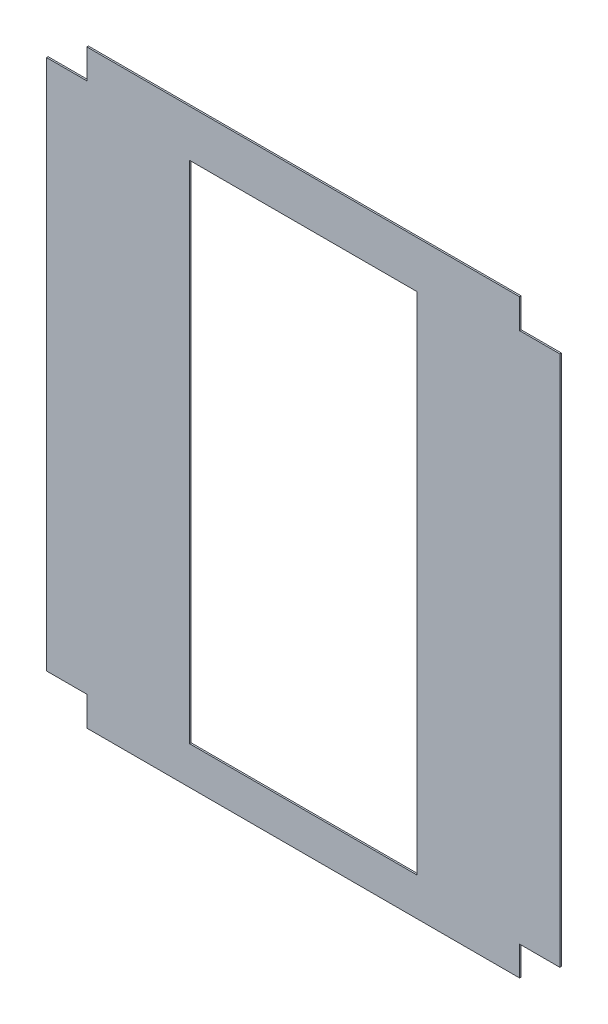
ISO-10303-21;
HEADER;
FILE_DESCRIPTION(('STEP AP214'),'2;1');
FILE_NAME('part.step','',(''),(''),'','','');
FILE_SCHEMA(('AUTOMOTIVE_DESIGN { 1 0 10303 214 1 1 1 1 }'));
ENDSEC;
DATA;
#1=APPLICATION_CONTEXT('core data for automotive mechanical design processes');
#2=APPLICATION_PROTOCOL_DEFINITION('international standard','automotive_design',2000,#1);
#3=PRODUCT_CONTEXT('',#1,'mechanical');
#4=PRODUCT('Part','Part','',(#3));
#5=PRODUCT_RELATED_PRODUCT_CATEGORY('part','',(#4));
#6=PRODUCT_DEFINITION_FORMATION('','',#4);
#7=PRODUCT_DEFINITION_CONTEXT('part definition',#1,'design');
#8=PRODUCT_DEFINITION('design','',#6,#7);
#9=PRODUCT_DEFINITION_SHAPE('','',#8);
#10=(LENGTH_UNIT() NAMED_UNIT(*) SI_UNIT(.MILLI.,.METRE.));
#11=(NAMED_UNIT(*) PLANE_ANGLE_UNIT() SI_UNIT($,.RADIAN.));
#12=(NAMED_UNIT(*) SI_UNIT($,.STERADIAN.) SOLID_ANGLE_UNIT());
#13=UNCERTAINTY_MEASURE_WITH_UNIT(LENGTH_MEASURE(1.E-05),#10,'distance_accuracy_value','');
#14=(GEOMETRIC_REPRESENTATION_CONTEXT(3) GLOBAL_UNCERTAINTY_ASSIGNED_CONTEXT((#13)) GLOBAL_UNIT_ASSIGNED_CONTEXT((#10,
#11,#12)) REPRESENTATION_CONTEXT('',''));
#15=CARTESIAN_POINT('',(0.,0.,0.));
#16=DIRECTION('',(0.,0.,1.));
#17=DIRECTION('',(1.,0.,0.));
#18=AXIS2_PLACEMENT_3D('',#15,#16,#17);
#19=CARTESIAN_POINT('',(0.,0.,6.35));
#20=DIRECTION('',(0.,0.,-1.));
#21=DIRECTION('',(-1.,0.,0.));
#22=AXIS2_PLACEMENT_3D('',#19,#20,#21);
#23=PLANE('',#22);
#24=DIRECTION('',(0.,1.,0.));
#25=VECTOR('',#24,1.);
#26=CARTESIAN_POINT('',(848.581697288669,1062.67558837392,6.35));
#27=LINE('',#26,#25);
#28=CARTESIAN_POINT('',(848.581697288669,-1073.95215165757,6.35));
#29=VERTEX_POINT('',#28);
#30=CARTESIAN_POINT('',(848.581697288669,1062.67558837392,6.35));
#31=VERTEX_POINT('',#30);
#32=EDGE_CURVE('E182',#29,#31,#27,.T.);
#33=ORIENTED_EDGE('',*,*,#32,.T.);
#34=DIRECTION('',(-1.,0.,0.));
#35=VECTOR('',#34,1.);
#36=CARTESIAN_POINT('',(686.529697288669,1062.67558837392,6.35));
#37=LINE('',#36,#35);
#38=CARTESIAN_POINT('',(686.529697288669,1062.67558837392,6.35));
#39=VERTEX_POINT('',#38);
#40=EDGE_CURVE('E185',#31,#39,#37,.T.);
#41=ORIENTED_EDGE('',*,*,#40,.T.);
#42=DIRECTION('',(0.,1.,0.));
#43=VECTOR('',#42,1.);
#44=CARTESIAN_POINT('',(686.529697288669,1180.78558837392,6.35));
#45=LINE('',#44,#43);
#46=CARTESIAN_POINT('',(686.529697288669,1180.78558837392,6.35));
#47=VERTEX_POINT('',#46);
#48=EDGE_CURVE('E188',#39,#47,#45,.T.);
#49=ORIENTED_EDGE('',*,*,#48,.T.);
#50=DIRECTION('',(-1.,0.,0.));
#51=VECTOR('',#50,1.);
#52=CARTESIAN_POINT('',(-1053.973,1180.78558837392,6.35));
#53=LINE('',#52,#51);
#54=CARTESIAN_POINT('',(-1053.973,1180.78558837392,6.35));
#55=VERTEX_POINT('',#54);
#56=EDGE_CURVE('E190',#47,#55,#53,.T.);
#57=ORIENTED_EDGE('',*,*,#56,.T.);
#58=DIRECTION('',(0.,-1.,0.));
#59=VECTOR('',#58,1.);
#60=CARTESIAN_POINT('',(-1053.973,1062.67558837392,6.35));
#61=LINE('',#60,#59);
#62=CARTESIAN_POINT('',(-1053.973,1062.67558837392,6.35));
#63=VERTEX_POINT('',#62);
#64=EDGE_CURVE('E192',#55,#63,#61,.T.);
#65=ORIENTED_EDGE('',*,*,#64,.T.);
#66=DIRECTION('',(-1.,0.,0.));
#67=VECTOR('',#66,1.);
#68=CARTESIAN_POINT('',(-1216.025,1062.67558837392,6.35));
#69=LINE('',#68,#67);
#70=CARTESIAN_POINT('',(-1216.025,1062.67558837392,6.35));
#71=VERTEX_POINT('',#70);
#72=EDGE_CURVE('E194',#63,#71,#69,.T.);
#73=ORIENTED_EDGE('',*,*,#72,.T.);
#74=DIRECTION('',(0.,-1.,0.));
#75=VECTOR('',#74,1.);
#76=CARTESIAN_POINT('',(-1216.025,-1073.95215165757,6.35));
#77=LINE('',#76,#75);
#78=CARTESIAN_POINT('',(-1216.025,-1073.95215165757,6.35));
#79=VERTEX_POINT('',#78);
#80=EDGE_CURVE('E196',#71,#79,#77,.T.);
#81=ORIENTED_EDGE('',*,*,#80,.T.);
#82=DIRECTION('',(1.,0.,0.));
#83=VECTOR('',#82,1.);
#84=CARTESIAN_POINT('',(-1053.973,-1073.95215165757,6.35));
#85=LINE('',#84,#83);
#86=CARTESIAN_POINT('',(-1053.973,-1073.95215165757,6.35));
#87=VERTEX_POINT('',#86);
#88=EDGE_CURVE('E198',#79,#87,#85,.T.);
#89=ORIENTED_EDGE('',*,*,#88,.T.);
#90=DIRECTION('',(0.,-1.,0.));
#91=VECTOR('',#90,1.);
#92=CARTESIAN_POINT('',(-1053.973,-1192.06215165757,6.35));
#93=LINE('',#92,#91);
#94=CARTESIAN_POINT('',(-1053.973,-1192.06215165757,6.35));
#95=VERTEX_POINT('',#94);
#96=EDGE_CURVE('E200',#87,#95,#93,.T.);
#97=ORIENTED_EDGE('',*,*,#96,.T.);
#98=DIRECTION('',(1.,0.,0.));
#99=VECTOR('',#98,1.);
#100=CARTESIAN_POINT('',(-1053.973,-1192.06215165757,6.35));
#101=LINE('',#100,#99);
#102=CARTESIAN_POINT('',(686.529697288669,-1192.06215165757,6.35));
#103=VERTEX_POINT('',#102);
#104=EDGE_CURVE('E202',#95,#103,#101,.T.);
#105=ORIENTED_EDGE('',*,*,#104,.T.);
#106=DIRECTION('',(0.,1.,0.));
#107=VECTOR('',#106,1.);
#108=CARTESIAN_POINT('',(686.529697288669,-1073.95215165757,6.35));
#109=LINE('',#108,#107);
#110=CARTESIAN_POINT('',(686.529697288669,-1073.95215165757,6.35));
#111=VERTEX_POINT('',#110);
#112=EDGE_CURVE('E204',#103,#111,#109,.T.);
#113=ORIENTED_EDGE('',*,*,#112,.T.);
#114=DIRECTION('',(1.,0.,0.));
#115=VECTOR('',#114,1.);
#116=CARTESIAN_POINT('',(848.581697288669,-1073.95215165757,6.35));
#117=LINE('',#116,#115);
#118=EDGE_CURVE('E206',#111,#29,#117,.T.);
#119=ORIENTED_EDGE('',*,*,#118,.T.);
#120=EDGE_LOOP('',(#33,#41,#49,#57,#65,#73,#81,#89,#97,#105,#113,#119));
#121=FACE_BOUND('',#120,.T.);
#122=DIRECTION('',(0.,-1.,0.));
#123=VECTOR('',#122,1.);
#124=CARTESIAN_POINT('',(-640.714999999999,-1039.66215165757,6.35));
#125=LINE('',#124,#123);
#126=CARTESIAN_POINT('',(-640.714999999999,992.337848342434,6.35));
#127=VERTEX_POINT('',#126);
#128=CARTESIAN_POINT('',(-640.714999999999,-1039.66215165757,6.35));
#129=VERTEX_POINT('',#128);
#130=EDGE_CURVE('E146',#127,#129,#125,.T.);
#131=ORIENTED_EDGE('',*,*,#130,.F.);
#132=DIRECTION('',(-1.,0.,0.));
#133=VECTOR('',#132,1.);
#134=CARTESIAN_POINT('',(-640.714999999999,992.337848342434,6.35));
#135=LINE('',#134,#133);
#136=CARTESIAN_POINT('',(273.685,992.337848342434,6.35));
#137=VERTEX_POINT('',#136);
#138=EDGE_CURVE('E168',#137,#127,#135,.T.);
#139=ORIENTED_EDGE('',*,*,#138,.F.);
#140=DIRECTION('',(0.,1.,0.));
#141=VECTOR('',#140,1.);
#142=CARTESIAN_POINT('',(273.685,992.337848342434,6.35));
#143=LINE('',#142,#141);
#144=CARTESIAN_POINT('',(273.685000000001,-1039.66215165757,6.35));
#145=VERTEX_POINT('',#144);
#146=EDGE_CURVE('E166',#145,#137,#143,.T.);
#147=ORIENTED_EDGE('',*,*,#146,.F.);
#148=DIRECTION('',(1.,0.,0.));
#149=VECTOR('',#148,1.);
#150=CARTESIAN_POINT('',(-640.714999999999,-1039.66215165757,6.35));
#151=LINE('',#150,#149);
#152=EDGE_CURVE('E154',#129,#145,#151,.T.);
#153=ORIENTED_EDGE('',*,*,#152,.F.);
#154=EDGE_LOOP('',(#131,#139,#147,#153));
#155=FACE_BOUND('',#154,.T.);
#156=ADVANCED_FACE('F33',(#121,#155),#23,.F.);
#157=CARTESIAN_POINT('',(0.,0.,0.));
#158=DIRECTION('',(0.,0.,-1.));
#159=DIRECTION('',(-1.,0.,0.));
#160=AXIS2_PLACEMENT_3D('',#157,#158,#159);
#161=PLANE('',#160);
#162=DIRECTION('',(0.,1.,0.));
#163=VECTOR('',#162,1.);
#164=CARTESIAN_POINT('',(848.581697288669,1062.67558837392,0.));
#165=LINE('',#164,#163);
#166=CARTESIAN_POINT('',(848.581697288669,-1073.95215165757,0.));
#167=VERTEX_POINT('',#166);
#168=CARTESIAN_POINT('',(848.581697288669,1062.67558837392,0.));
#169=VERTEX_POINT('',#168);
#170=EDGE_CURVE('E162',#167,#169,#165,.T.);
#171=ORIENTED_EDGE('',*,*,#170,.F.);
#172=DIRECTION('',(1.,0.,0.));
#173=VECTOR('',#172,1.);
#174=CARTESIAN_POINT('',(848.581697288669,-1073.95215165757,0.));
#175=LINE('',#174,#173);
#176=CARTESIAN_POINT('',(686.529697288669,-1073.95215165757,0.));
#177=VERTEX_POINT('',#176);
#178=EDGE_CURVE('E186',#177,#167,#175,.T.);
#179=ORIENTED_EDGE('',*,*,#178,.F.);
#180=DIRECTION('',(0.,1.,0.));
#181=VECTOR('',#180,1.);
#182=CARTESIAN_POINT('',(686.529697288669,-1073.95215165757,0.));
#183=LINE('',#182,#181);
#184=CARTESIAN_POINT('',(686.529697288669,-1192.06215165757,0.));
#185=VERTEX_POINT('',#184);
#186=EDGE_CURVE('E230',#185,#177,#183,.T.);
#187=ORIENTED_EDGE('',*,*,#186,.F.);
#188=DIRECTION('',(1.,0.,0.));
#189=VECTOR('',#188,1.);
#190=CARTESIAN_POINT('',(477.952095390508,-1192.06215165757,0.));
#191=LINE('',#190,#189);
#192=CARTESIAN_POINT('',(-1053.973,-1192.06215165757,0.));
#193=VERTEX_POINT('',#192);
#194=EDGE_CURVE('E228',#193,#185,#191,.T.);
#195=ORIENTED_EDGE('',*,*,#194,.F.);
#196=DIRECTION('',(0.,-1.,0.));
#197=VECTOR('',#196,1.);
#198=CARTESIAN_POINT('',(-1053.973,-1192.06215165757,0.));
#199=LINE('',#198,#197);
#200=CARTESIAN_POINT('',(-1053.973,-1073.95215165757,0.));
#201=VERTEX_POINT('',#200);
#202=EDGE_CURVE('E225',#201,#193,#199,.T.);
#203=ORIENTED_EDGE('',*,*,#202,.F.);
#204=DIRECTION('',(1.,0.,0.));
#205=VECTOR('',#204,1.);
#206=CARTESIAN_POINT('',(-1053.973,-1073.95215165757,0.));
#207=LINE('',#206,#205);
#208=CARTESIAN_POINT('',(-1216.025,-1073.95215165757,0.));
#209=VERTEX_POINT('',#208);
#210=EDGE_CURVE('E223',#209,#201,#207,.T.);
#211=ORIENTED_EDGE('',*,*,#210,.F.);
#212=DIRECTION('',(0.,-1.,0.));
#213=VECTOR('',#212,1.);
#214=CARTESIAN_POINT('',(-1216.025,-1073.95215165757,0.));
#215=LINE('',#214,#213);
#216=CARTESIAN_POINT('',(-1216.025,1062.67558837392,0.));
#217=VERTEX_POINT('',#216);
#218=EDGE_CURVE('E221',#217,#209,#215,.T.);
#219=ORIENTED_EDGE('',*,*,#218,.F.);
#220=DIRECTION('',(-1.,0.,0.));
#221=VECTOR('',#220,1.);
#222=CARTESIAN_POINT('',(-1216.025,1062.67558837392,0.));
#223=LINE('',#222,#221);
#224=CARTESIAN_POINT('',(-1053.973,1062.67558837392,0.));
#225=VERTEX_POINT('',#224);
#226=EDGE_CURVE('E219',#225,#217,#223,.T.);
#227=ORIENTED_EDGE('',*,*,#226,.F.);
#228=DIRECTION('',(0.,-1.,0.));
#229=VECTOR('',#228,1.);
#230=CARTESIAN_POINT('',(-1053.973,1062.67558837392,0.));
#231=LINE('',#230,#229);
#232=CARTESIAN_POINT('',(-1053.973,1180.78558837392,0.));
#233=VERTEX_POINT('',#232);
#234=EDGE_CURVE('E217',#233,#225,#231,.T.);
#235=ORIENTED_EDGE('',*,*,#234,.F.);
#236=DIRECTION('',(-1.,0.,0.));
#237=VECTOR('',#236,1.);
#238=CARTESIAN_POINT('',(-1053.973,1180.78558837392,0.));
#239=LINE('',#238,#237);
#240=CARTESIAN_POINT('',(686.529697288669,1180.78558837392,0.));
#241=VERTEX_POINT('',#240);
#242=EDGE_CURVE('E215',#241,#233,#239,.T.);
#243=ORIENTED_EDGE('',*,*,#242,.F.);
#244=DIRECTION('',(0.,1.,0.));
#245=VECTOR('',#244,1.);
#246=CARTESIAN_POINT('',(686.529697288669,1180.78558837392,0.));
#247=LINE('',#246,#245);
#248=CARTESIAN_POINT('',(686.529697288669,1062.67558837392,0.));
#249=VERTEX_POINT('',#248);
#250=EDGE_CURVE('E213',#249,#241,#247,.T.);
#251=ORIENTED_EDGE('',*,*,#250,.F.);
#252=DIRECTION('',(-1.,0.,0.));
#253=VECTOR('',#252,1.);
#254=CARTESIAN_POINT('',(686.529697288669,1062.67558837392,0.));
#255=LINE('',#254,#253);
#256=EDGE_CURVE('E211',#169,#249,#255,.T.);
#257=ORIENTED_EDGE('',*,*,#256,.F.);
#258=EDGE_LOOP('',(#171,#179,#187,#195,#203,#211,#219,#227,#235,#243,#251,#257));
#259=FACE_BOUND('',#258,.T.);
#260=DIRECTION('',(-1.,0.,0.));
#261=VECTOR('',#260,1.);
#262=CARTESIAN_POINT('',(-640.714999999999,992.337848342434,0.));
#263=LINE('',#262,#261);
#264=CARTESIAN_POINT('',(273.685,992.337848342434,0.));
#265=VERTEX_POINT('',#264);
#266=CARTESIAN_POINT('',(-640.714999999999,992.337848342434,0.));
#267=VERTEX_POINT('',#266);
#268=EDGE_CURVE('E155',#265,#267,#263,.T.);
#269=ORIENTED_EDGE('',*,*,#268,.T.);
#270=DIRECTION('',(0.,-1.,0.));
#271=VECTOR('',#270,1.);
#272=CARTESIAN_POINT('',(-640.714999999999,-1039.66215165757,0.));
#273=LINE('',#272,#271);
#274=CARTESIAN_POINT('',(-640.714999999999,-1039.66215165757,0.));
#275=VERTEX_POINT('',#274);
#276=EDGE_CURVE('E56',#267,#275,#273,.T.);
#277=ORIENTED_EDGE('',*,*,#276,.T.);
#278=DIRECTION('',(1.,0.,0.));
#279=VECTOR('',#278,1.);
#280=CARTESIAN_POINT('',(-640.714999999999,-1039.66215165757,0.));
#281=LINE('',#280,#279);
#282=CARTESIAN_POINT('',(273.685000000001,-1039.66215165757,0.));
#283=VERTEX_POINT('',#282);
#284=EDGE_CURVE('E161',#275,#283,#281,.T.);
#285=ORIENTED_EDGE('',*,*,#284,.T.);
#286=DIRECTION('',(0.,1.,0.));
#287=VECTOR('',#286,1.);
#288=CARTESIAN_POINT('',(273.685,992.337848342434,0.));
#289=LINE('',#288,#287);
#290=EDGE_CURVE('E174',#283,#265,#289,.T.);
#291=ORIENTED_EDGE('',*,*,#290,.T.);
#292=EDGE_LOOP('',(#269,#277,#285,#291));
#293=FACE_BOUND('',#292,.T.);
#294=ADVANCED_FACE('F272',(#259,#293),#161,.T.);
#295=CARTESIAN_POINT('',(848.581697288669,1062.67558837392,6.35));
#296=DIRECTION('',(-1.,0.,0.));
#297=DIRECTION('',(0.,-1.,0.));
#298=AXIS2_PLACEMENT_3D('',#295,#296,#297);
#299=PLANE('',#298);
#300=ORIENTED_EDGE('',*,*,#170,.T.);
#301=DIRECTION('',(0.,0.,-1.));
#302=VECTOR('',#301,1.);
#303=CARTESIAN_POINT('',(848.581697288669,1062.67558837392,6.35));
#304=LINE('',#303,#302);
#305=EDGE_CURVE('E11',#31,#169,#304,.T.);
#306=ORIENTED_EDGE('',*,*,#305,.F.);
#307=ORIENTED_EDGE('',*,*,#32,.F.);
#308=DIRECTION('',(0.,0.,-1.));
#309=VECTOR('',#308,1.);
#310=CARTESIAN_POINT('',(848.581697288669,-1073.95215165757,6.35));
#311=LINE('',#310,#309);
#312=EDGE_CURVE('E208',#29,#167,#311,.T.);
#313=ORIENTED_EDGE('',*,*,#312,.T.);
#314=EDGE_LOOP('',(#300,#306,#307,#313));
#315=FACE_BOUND('',#314,.T.);
#316=ADVANCED_FACE('F35',(#315),#299,.F.);
#317=CARTESIAN_POINT('',(686.529697288669,1062.67558837392,6.35));
#318=DIRECTION('',(0.,-1.,0.));
#319=DIRECTION('',(0.,0.,-1.));
#320=AXIS2_PLACEMENT_3D('',#317,#318,#319);
#321=PLANE('',#320);
#322=ORIENTED_EDGE('',*,*,#256,.T.);
#323=DIRECTION('',(0.,0.,-1.));
#324=VECTOR('',#323,1.);
#325=CARTESIAN_POINT('',(686.529697288669,1062.67558837392,6.35));
#326=LINE('',#325,#324);
#327=EDGE_CURVE('E41',#39,#249,#326,.T.);
#328=ORIENTED_EDGE('',*,*,#327,.F.);
#329=ORIENTED_EDGE('',*,*,#40,.F.);
#330=ORIENTED_EDGE('',*,*,#305,.T.);
#331=EDGE_LOOP('',(#322,#328,#329,#330));
#332=FACE_BOUND('',#331,.T.);
#333=ADVANCED_FACE('F289',(#332),#321,.F.);
#334=CARTESIAN_POINT('',(686.529697288669,1180.78558837392,6.35));
#335=DIRECTION('',(-1.,0.,0.));
#336=DIRECTION('',(0.,0.,1.));
#337=AXIS2_PLACEMENT_3D('',#334,#335,#336);
#338=PLANE('',#337);
#339=ORIENTED_EDGE('',*,*,#250,.T.);
#340=DIRECTION('',(0.,0.,-1.));
#341=VECTOR('',#340,1.);
#342=CARTESIAN_POINT('',(686.529697288669,1180.78558837392,6.35));
#343=LINE('',#342,#341);
#344=EDGE_CURVE('E259',#47,#241,#343,.T.);
#345=ORIENTED_EDGE('',*,*,#344,.F.);
#346=ORIENTED_EDGE('',*,*,#48,.F.);
#347=ORIENTED_EDGE('',*,*,#327,.T.);
#348=EDGE_LOOP('',(#339,#345,#346,#347));
#349=FACE_BOUND('',#348,.T.);
#350=ADVANCED_FACE('F266',(#349),#338,.F.);
#351=CARTESIAN_POINT('',(-1053.973,1180.78558837392,6.35));
#352=DIRECTION('',(0.,-1.,0.));
#353=DIRECTION('',(1.,0.,0.));
#354=AXIS2_PLACEMENT_3D('',#351,#352,#353);
#355=PLANE('',#354);
#356=ORIENTED_EDGE('',*,*,#242,.T.);
#357=DIRECTION('',(0.,0.,-1.));
#358=VECTOR('',#357,1.);
#359=CARTESIAN_POINT('',(-1053.973,1180.78558837392,6.35));
#360=LINE('',#359,#358);
#361=EDGE_CURVE('E256',#55,#233,#360,.T.);
#362=ORIENTED_EDGE('',*,*,#361,.F.);
#363=ORIENTED_EDGE('',*,*,#56,.F.);
#364=ORIENTED_EDGE('',*,*,#344,.T.);
#365=EDGE_LOOP('',(#356,#362,#363,#364));
#366=FACE_BOUND('',#365,.T.);
#367=ADVANCED_FACE('F278',(#366),#355,.F.);
#368=CARTESIAN_POINT('',(-1053.973,1062.67558837392,6.35));
#369=DIRECTION('',(1.,0.,0.));
#370=DIRECTION('',(0.,1.,0.));
#371=AXIS2_PLACEMENT_3D('',#368,#369,#370);
#372=PLANE('',#371);
#373=ORIENTED_EDGE('',*,*,#234,.T.);
#374=DIRECTION('',(0.,0.,-1.));
#375=VECTOR('',#374,1.);
#376=CARTESIAN_POINT('',(-1053.973,1062.67558837392,6.35));
#377=LINE('',#376,#375);
#378=EDGE_CURVE('E253',#63,#225,#377,.T.);
#379=ORIENTED_EDGE('',*,*,#378,.F.);
#380=ORIENTED_EDGE('',*,*,#64,.F.);
#381=ORIENTED_EDGE('',*,*,#361,.T.);
#382=EDGE_LOOP('',(#373,#379,#380,#381));
#383=FACE_BOUND('',#382,.T.);
#384=ADVANCED_FACE('F282',(#383),#372,.F.);
#385=CARTESIAN_POINT('',(-1216.025,1062.67558837392,6.35));
#386=DIRECTION('',(0.,-1.,0.));
#387=DIRECTION('',(0.,0.,-1.));
#388=AXIS2_PLACEMENT_3D('',#385,#386,#387);
#389=PLANE('',#388);
#390=ORIENTED_EDGE('',*,*,#226,.T.);
#391=DIRECTION('',(0.,0.,-1.));
#392=VECTOR('',#391,1.);
#393=CARTESIAN_POINT('',(-1216.025,1062.67558837392,6.35));
#394=LINE('',#393,#392);
#395=EDGE_CURVE('E250',#71,#217,#394,.T.);
#396=ORIENTED_EDGE('',*,*,#395,.F.);
#397=ORIENTED_EDGE('',*,*,#72,.F.);
#398=ORIENTED_EDGE('',*,*,#378,.T.);
#399=EDGE_LOOP('',(#390,#396,#397,#398));
#400=FACE_BOUND('',#399,.T.);
#401=ADVANCED_FACE('F321',(#400),#389,.F.);
#402=CARTESIAN_POINT('',(-1216.025,-1073.95215165757,6.35));
#403=DIRECTION('',(1.,0.,0.));
#404=DIRECTION('',(0.,0.,-1.));
#405=AXIS2_PLACEMENT_3D('',#402,#403,#404);
#406=PLANE('',#405);
#407=ORIENTED_EDGE('',*,*,#218,.T.);
#408=DIRECTION('',(0.,0.,-1.));
#409=VECTOR('',#408,1.);
#410=CARTESIAN_POINT('',(-1216.025,-1073.95215165757,6.35));
#411=LINE('',#410,#409);
#412=EDGE_CURVE('E247',#79,#209,#411,.T.);
#413=ORIENTED_EDGE('',*,*,#412,.F.);
#414=ORIENTED_EDGE('',*,*,#80,.F.);
#415=ORIENTED_EDGE('',*,*,#395,.T.);
#416=EDGE_LOOP('',(#407,#413,#414,#415));
#417=FACE_BOUND('',#416,.T.);
#418=ADVANCED_FACE('F318',(#417),#406,.F.);
#419=CARTESIAN_POINT('',(-1053.973,-1073.95215165757,6.35));
#420=DIRECTION('',(0.,1.,0.));
#421=DIRECTION('',(0.,0.,1.));
#422=AXIS2_PLACEMENT_3D('',#419,#420,#421);
#423=PLANE('',#422);
#424=ORIENTED_EDGE('',*,*,#210,.T.);
#425=DIRECTION('',(0.,0.,-1.));
#426=VECTOR('',#425,1.);
#427=CARTESIAN_POINT('',(-1053.973,-1073.95215165757,6.35));
#428=LINE('',#427,#426);
#429=EDGE_CURVE('E244',#87,#201,#428,.T.);
#430=ORIENTED_EDGE('',*,*,#429,.F.);
#431=ORIENTED_EDGE('',*,*,#88,.F.);
#432=ORIENTED_EDGE('',*,*,#412,.T.);
#433=EDGE_LOOP('',(#424,#430,#431,#432));
#434=FACE_BOUND('',#433,.T.);
#435=ADVANCED_FACE('F314',(#434),#423,.F.);
#436=CARTESIAN_POINT('',(-1053.973,-1192.06215165757,6.35));
#437=DIRECTION('',(1.,0.,0.));
#438=DIRECTION('',(0.,0.,-1.));
#439=AXIS2_PLACEMENT_3D('',#436,#437,#438);
#440=PLANE('',#439);
#441=ORIENTED_EDGE('',*,*,#202,.T.);
#442=DIRECTION('',(0.,0.,-1.));
#443=VECTOR('',#442,1.);
#444=CARTESIAN_POINT('',(-1053.973,-1192.06215165757,6.35));
#445=LINE('',#444,#443);
#446=EDGE_CURVE('E241',#95,#193,#445,.T.);
#447=ORIENTED_EDGE('',*,*,#446,.F.);
#448=ORIENTED_EDGE('',*,*,#96,.F.);
#449=ORIENTED_EDGE('',*,*,#429,.T.);
#450=EDGE_LOOP('',(#441,#447,#448,#449));
#451=FACE_BOUND('',#450,.T.);
#452=ADVANCED_FACE('F309',(#451),#440,.F.);
#453=CARTESIAN_POINT('',(477.952095390508,-1192.06215165757,6.35));
#454=DIRECTION('',(0.,1.,0.));
#455=DIRECTION('',(0.,0.,1.));
#456=AXIS2_PLACEMENT_3D('',#453,#454,#455);
#457=PLANE('',#456);
#458=ORIENTED_EDGE('',*,*,#194,.T.);
#459=DIRECTION('',(0.,0.,-1.));
#460=VECTOR('',#459,1.);
#461=CARTESIAN_POINT('',(686.529697288669,-1192.06215165757,6.35));
#462=LINE('',#461,#460);
#463=EDGE_CURVE('E238',#103,#185,#462,.T.);
#464=ORIENTED_EDGE('',*,*,#463,.F.);
#465=ORIENTED_EDGE('',*,*,#104,.F.);
#466=ORIENTED_EDGE('',*,*,#446,.T.);
#467=EDGE_LOOP('',(#458,#464,#465,#466));
#468=FACE_BOUND('',#467,.T.);
#469=ADVANCED_FACE('F304',(#468),#457,.F.);
#470=CARTESIAN_POINT('',(686.529697288669,-1073.95215165757,6.35));
#471=DIRECTION('',(-1.,0.,0.));
#472=DIRECTION('',(0.,-1.,0.));
#473=AXIS2_PLACEMENT_3D('',#470,#471,#472);
#474=PLANE('',#473);
#475=ORIENTED_EDGE('',*,*,#186,.T.);
#476=DIRECTION('',(0.,0.,-1.));
#477=VECTOR('',#476,1.);
#478=CARTESIAN_POINT('',(686.529697288669,-1073.95215165757,6.35));
#479=LINE('',#478,#477);
#480=EDGE_CURVE('E235',#111,#177,#479,.T.);
#481=ORIENTED_EDGE('',*,*,#480,.F.);
#482=ORIENTED_EDGE('',*,*,#112,.F.);
#483=ORIENTED_EDGE('',*,*,#463,.T.);
#484=EDGE_LOOP('',(#475,#481,#482,#483));
#485=FACE_BOUND('',#484,.T.);
#486=ADVANCED_FACE('F300',(#485),#474,.F.);
#487=CARTESIAN_POINT('',(848.581697288669,-1073.95215165757,6.35));
#488=DIRECTION('',(0.,1.,0.));
#489=DIRECTION('',(0.,0.,1.));
#490=AXIS2_PLACEMENT_3D('',#487,#488,#489);
#491=PLANE('',#490);
#492=ORIENTED_EDGE('',*,*,#178,.T.);
#493=ORIENTED_EDGE('',*,*,#312,.F.);
#494=ORIENTED_EDGE('',*,*,#118,.F.);
#495=ORIENTED_EDGE('',*,*,#480,.T.);
#496=EDGE_LOOP('',(#492,#493,#494,#495));
#497=FACE_BOUND('',#496,.T.);
#498=ADVANCED_FACE('F295',(#497),#491,.F.);
#499=CARTESIAN_POINT('',(-640.714999999999,-1039.66215165757,6.35));
#500=DIRECTION('',(1.,0.,0.));
#501=DIRECTION('',(0.,0.,-1.));
#502=AXIS2_PLACEMENT_3D('',#499,#500,#501);
#503=PLANE('',#502);
#504=ORIENTED_EDGE('',*,*,#276,.F.);
#505=DIRECTION('',(0.,0.,-1.));
#506=VECTOR('',#505,1.);
#507=CARTESIAN_POINT('',(-640.714999999999,992.337848342434,6.35));
#508=LINE('',#507,#506);
#509=EDGE_CURVE('E150',#127,#267,#508,.T.);
#510=ORIENTED_EDGE('',*,*,#509,.F.);
#511=ORIENTED_EDGE('',*,*,#130,.T.);
#512=DIRECTION('',(0.,0.,-1.));
#513=VECTOR('',#512,1.);
#514=CARTESIAN_POINT('',(-640.714999999999,-1039.66215165757,6.35));
#515=LINE('',#514,#513);
#516=EDGE_CURVE('E149',#129,#275,#515,.T.);
#517=ORIENTED_EDGE('',*,*,#516,.T.);
#518=EDGE_LOOP('',(#504,#510,#511,#517));
#519=FACE_BOUND('',#518,.T.);
#520=ADVANCED_FACE('F148',(#519),#503,.T.);
#521=CARTESIAN_POINT('',(-640.714999999999,-1039.66215165757,6.35));
#522=DIRECTION('',(0.,1.,0.));
#523=DIRECTION('',(0.,0.,1.));
#524=AXIS2_PLACEMENT_3D('',#521,#522,#523);
#525=PLANE('',#524);
#526=ORIENTED_EDGE('',*,*,#284,.F.);
#527=ORIENTED_EDGE('',*,*,#516,.F.);
#528=ORIENTED_EDGE('',*,*,#152,.T.);
#529=DIRECTION('',(0.,0.,-1.));
#530=VECTOR('',#529,1.);
#531=CARTESIAN_POINT('',(273.685000000001,-1039.66215165757,6.35));
#532=LINE('',#531,#530);
#533=EDGE_CURVE('E163',#145,#283,#532,.T.);
#534=ORIENTED_EDGE('',*,*,#533,.T.);
#535=EDGE_LOOP('',(#526,#527,#528,#534));
#536=FACE_BOUND('',#535,.T.);
#537=ADVANCED_FACE('F158',(#536),#525,.T.);
#538=CARTESIAN_POINT('',(273.685,992.337848342434,6.35));
#539=DIRECTION('',(-1.,0.,0.));
#540=DIRECTION('',(0.,-1.,0.));
#541=AXIS2_PLACEMENT_3D('',#538,#539,#540);
#542=PLANE('',#541);
#543=ORIENTED_EDGE('',*,*,#290,.F.);
#544=ORIENTED_EDGE('',*,*,#533,.F.);
#545=ORIENTED_EDGE('',*,*,#146,.T.);
#546=DIRECTION('',(0.,0.,-1.));
#547=VECTOR('',#546,1.);
#548=CARTESIAN_POINT('',(273.685,992.337848342434,6.35));
#549=LINE('',#548,#547);
#550=EDGE_CURVE('E48',#137,#265,#549,.T.);
#551=ORIENTED_EDGE('',*,*,#550,.T.);
#552=EDGE_LOOP('',(#543,#544,#545,#551));
#553=FACE_BOUND('',#552,.T.);
#554=ADVANCED_FACE('F379',(#553),#542,.T.);
#555=CARTESIAN_POINT('',(-640.714999999999,992.337848342434,6.35));
#556=DIRECTION('',(0.,-1.,0.));
#557=DIRECTION('',(0.,0.,-1.));
#558=AXIS2_PLACEMENT_3D('',#555,#556,#557);
#559=PLANE('',#558);
#560=ORIENTED_EDGE('',*,*,#268,.F.);
#561=ORIENTED_EDGE('',*,*,#550,.F.);
#562=ORIENTED_EDGE('',*,*,#138,.T.);
#563=ORIENTED_EDGE('',*,*,#509,.T.);
#564=EDGE_LOOP('',(#560,#561,#562,#563));
#565=FACE_BOUND('',#564,.T.);
#566=ADVANCED_FACE('F385',(#565),#559,.T.);
#567=CLOSED_SHELL('',(#156,#294,#316,#333,#350,#367,#384,#401,#418,#435,#452,#469,#486,#498,
#520,#537,#554,#566));
#568=MANIFOLD_SOLID_BREP('B2',#567);
#569=ADVANCED_BREP_SHAPE_REPRESENTATION('',(#18,#568),#14);
#570=SHAPE_DEFINITION_REPRESENTATION(#9,#569);
ENDSEC;
END-ISO-10303-21;
